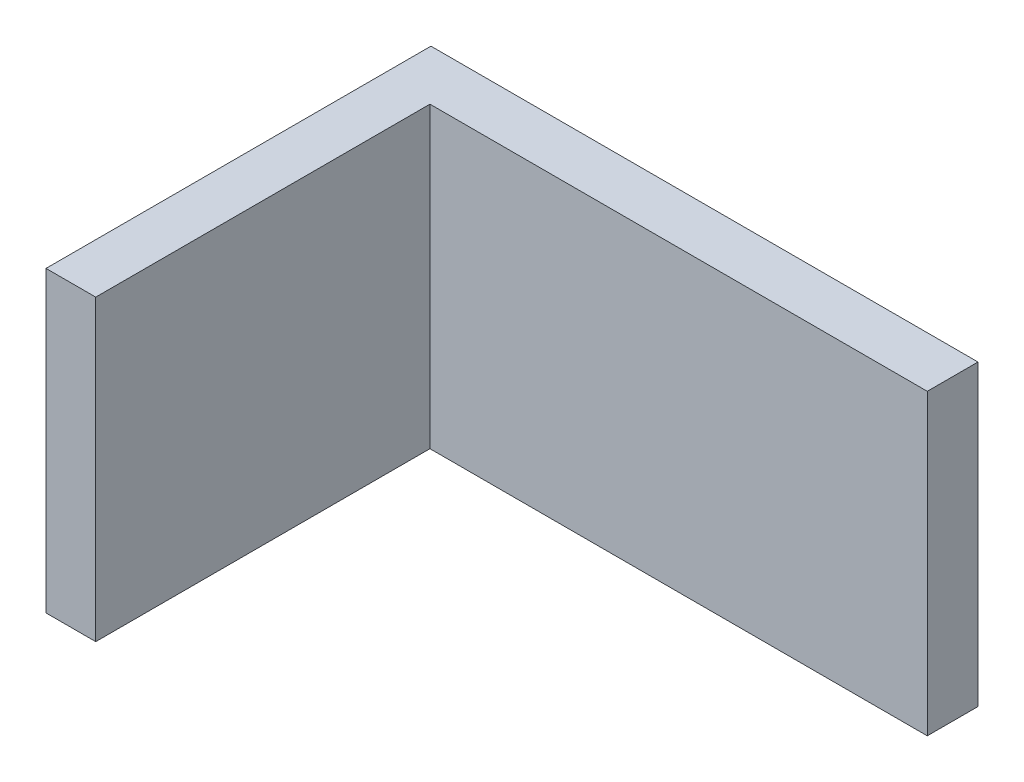
ISO-10303-21;
HEADER;
FILE_DESCRIPTION(('STEP AP214'),'2;1');
FILE_NAME('part.step','',(''),(''),'','','');
FILE_SCHEMA(('AUTOMOTIVE_DESIGN { 1 0 10303 214 1 1 1 1 }'));
ENDSEC;
DATA;
#1=APPLICATION_CONTEXT('core data for automotive mechanical design processes');
#2=APPLICATION_PROTOCOL_DEFINITION('international standard','automotive_design',2000,#1);
#3=PRODUCT_CONTEXT('',#1,'mechanical');
#4=PRODUCT('Part','Part','',(#3));
#5=PRODUCT_RELATED_PRODUCT_CATEGORY('part','',(#4));
#6=PRODUCT_DEFINITION_FORMATION('','',#4);
#7=PRODUCT_DEFINITION_CONTEXT('part definition',#1,'design');
#8=PRODUCT_DEFINITION('design','',#6,#7);
#9=PRODUCT_DEFINITION_SHAPE('','',#8);
#10=(LENGTH_UNIT() NAMED_UNIT(*) SI_UNIT(.MILLI.,.METRE.));
#11=(NAMED_UNIT(*) PLANE_ANGLE_UNIT() SI_UNIT($,.RADIAN.));
#12=(NAMED_UNIT(*) SI_UNIT($,.STERADIAN.) SOLID_ANGLE_UNIT());
#13=UNCERTAINTY_MEASURE_WITH_UNIT(LENGTH_MEASURE(1.E-05),#10,'distance_accuracy_value','');
#14=(GEOMETRIC_REPRESENTATION_CONTEXT(3) GLOBAL_UNCERTAINTY_ASSIGNED_CONTEXT((#13)) GLOBAL_UNIT_ASSIGNED_CONTEXT((#10,
#11,#12)) REPRESENTATION_CONTEXT('',''));
#15=CARTESIAN_POINT('',(0.,0.,0.));
#16=DIRECTION('',(0.,0.,1.));
#17=DIRECTION('',(1.,0.,0.));
#18=AXIS2_PLACEMENT_3D('',#15,#16,#17);
#19=CARTESIAN_POINT('',(-4.55,-0.9,0.));
#20=DIRECTION('',(0.,-1.,0.));
#21=DIRECTION('',(0.,0.,1.));
#22=AXIS2_PLACEMENT_3D('',#19,#20,#21);
#23=PLANE('',#22);
#24=DIRECTION('',(-1.,0.,0.));
#25=VECTOR('',#24,1.);
#26=CARTESIAN_POINT('',(-4.,-0.9,0.));
#27=LINE('',#26,#25);
#28=CARTESIAN_POINT('',(-4.,-0.9,0.));
#29=VERTEX_POINT('',#28);
#30=CARTESIAN_POINT('',(-4.55,-0.9,0.));
#31=VERTEX_POINT('',#30);
#32=EDGE_CURVE('E11',#29,#31,#27,.T.);
#33=ORIENTED_EDGE('',*,*,#32,.F.);
#34=DIRECTION('',(0.,0.,-1.));
#35=VECTOR('',#34,1.);
#36=CARTESIAN_POINT('',(-4.,-0.9,0.051));
#37=LINE('',#36,#35);
#38=CARTESIAN_POINT('',(-4.,-0.9,0.051));
#39=VERTEX_POINT('',#38);
#40=EDGE_CURVE('E24',#39,#29,#37,.T.);
#41=ORIENTED_EDGE('',*,*,#40,.F.);
#42=DIRECTION('',(1.,0.,0.));
#43=VECTOR('',#42,1.);
#44=CARTESIAN_POINT('',(-4.5,-0.9,0.051));
#45=LINE('',#44,#43);
#46=CARTESIAN_POINT('',(-4.5,-0.9,0.051));
#47=VERTEX_POINT('',#46);
#48=EDGE_CURVE('E87',#47,#39,#45,.T.);
#49=ORIENTED_EDGE('',*,*,#48,.F.);
#50=DIRECTION('',(0.,0.,-1.));
#51=VECTOR('',#50,1.);
#52=CARTESIAN_POINT('',(-4.5,-0.9,0.387));
#53=LINE('',#52,#51);
#54=CARTESIAN_POINT('',(-4.5,-0.9,0.387));
#55=VERTEX_POINT('',#54);
#56=EDGE_CURVE('E114',#55,#47,#53,.T.);
#57=ORIENTED_EDGE('',*,*,#56,.F.);
#58=DIRECTION('',(1.,0.,0.));
#59=VECTOR('',#58,1.);
#60=CARTESIAN_POINT('',(-4.55,-0.9,0.387));
#61=LINE('',#60,#59);
#62=CARTESIAN_POINT('',(-4.55,-0.9,0.387));
#63=VERTEX_POINT('',#62);
#64=EDGE_CURVE('E111',#63,#55,#61,.T.);
#65=ORIENTED_EDGE('',*,*,#64,.F.);
#66=DIRECTION('',(0.,0.,1.));
#67=VECTOR('',#66,1.);
#68=CARTESIAN_POINT('',(-4.55,-0.9,0.));
#69=LINE('',#68,#67);
#70=EDGE_CURVE('E108',#31,#63,#69,.T.);
#71=ORIENTED_EDGE('',*,*,#70,.F.);
#72=EDGE_LOOP('',(#33,#41,#49,#57,#65,#71));
#73=FACE_BOUND('',#72,.T.);
#74=ADVANCED_FACE('F17',(#73),#23,.T.);
#75=CARTESIAN_POINT('',(-4.,-0.6,0.));
#76=DIRECTION('',(0.,1.,0.));
#77=DIRECTION('',(0.,0.,1.));
#78=AXIS2_PLACEMENT_3D('',#75,#76,#77);
#79=PLANE('',#78);
#80=DIRECTION('',(1.,0.,0.));
#81=VECTOR('',#80,1.);
#82=CARTESIAN_POINT('',(-4.55,-0.6,0.));
#83=LINE('',#82,#81);
#84=CARTESIAN_POINT('',(-4.55,-0.6,0.));
#85=VERTEX_POINT('',#84);
#86=CARTESIAN_POINT('',(-4.,-0.6,0.));
#87=VERTEX_POINT('',#86);
#88=EDGE_CURVE('E106',#85,#87,#83,.T.);
#89=ORIENTED_EDGE('',*,*,#88,.F.);
#90=DIRECTION('',(0.,0.,-1.));
#91=VECTOR('',#90,1.);
#92=CARTESIAN_POINT('',(-4.55,-0.6,0.387));
#93=LINE('',#92,#91);
#94=CARTESIAN_POINT('',(-4.55,-0.6,0.387));
#95=VERTEX_POINT('',#94);
#96=EDGE_CURVE('E103',#95,#85,#93,.T.);
#97=ORIENTED_EDGE('',*,*,#96,.F.);
#98=DIRECTION('',(-1.,0.,0.));
#99=VECTOR('',#98,1.);
#100=CARTESIAN_POINT('',(-4.5,-0.6,0.387));
#101=LINE('',#100,#99);
#102=CARTESIAN_POINT('',(-4.5,-0.6,0.387));
#103=VERTEX_POINT('',#102);
#104=EDGE_CURVE('E100',#103,#95,#101,.T.);
#105=ORIENTED_EDGE('',*,*,#104,.F.);
#106=DIRECTION('',(0.,0.,1.));
#107=VECTOR('',#106,1.);
#108=CARTESIAN_POINT('',(-4.5,-0.6,0.051));
#109=LINE('',#108,#107);
#110=CARTESIAN_POINT('',(-4.5,-0.6,0.051));
#111=VERTEX_POINT('',#110);
#112=EDGE_CURVE('E72',#111,#103,#109,.T.);
#113=ORIENTED_EDGE('',*,*,#112,.F.);
#114=DIRECTION('',(-1.,0.,0.));
#115=VECTOR('',#114,1.);
#116=CARTESIAN_POINT('',(-4.,-0.6,0.051));
#117=LINE('',#116,#115);
#118=CARTESIAN_POINT('',(-4.,-0.6,0.051));
#119=VERTEX_POINT('',#118);
#120=EDGE_CURVE('E66',#119,#111,#117,.T.);
#121=ORIENTED_EDGE('',*,*,#120,.F.);
#122=DIRECTION('',(0.,0.,1.));
#123=VECTOR('',#122,1.);
#124=CARTESIAN_POINT('',(-4.,-0.6,0.));
#125=LINE('',#124,#123);
#126=EDGE_CURVE('E69',#87,#119,#125,.T.);
#127=ORIENTED_EDGE('',*,*,#126,.F.);
#128=EDGE_LOOP('',(#89,#97,#105,#113,#121,#127));
#129=FACE_BOUND('',#128,.T.);
#130=ADVANCED_FACE('F68',(#129),#79,.T.);
#131=CARTESIAN_POINT('',(-4.55,-0.9,0.387));
#132=DIRECTION('',(0.,0.,1.));
#133=DIRECTION('',(0.,1.,0.));
#134=AXIS2_PLACEMENT_3D('',#131,#132,#133);
#135=PLANE('',#134);
#136=ORIENTED_EDGE('',*,*,#64,.T.);
#137=DIRECTION('',(0.,-1.,0.));
#138=VECTOR('',#137,1.);
#139=CARTESIAN_POINT('',(-4.5,-0.6,0.387));
#140=LINE('',#139,#138);
#141=EDGE_CURVE('E83',#103,#55,#140,.T.);
#142=ORIENTED_EDGE('',*,*,#141,.F.);
#143=ORIENTED_EDGE('',*,*,#104,.T.);
#144=DIRECTION('',(0.,1.,0.));
#145=VECTOR('',#144,1.);
#146=CARTESIAN_POINT('',(-4.55,-0.9,0.387));
#147=LINE('',#146,#145);
#148=EDGE_CURVE('E88',#63,#95,#147,.T.);
#149=ORIENTED_EDGE('',*,*,#148,.F.);
#150=EDGE_LOOP('',(#136,#142,#143,#149));
#151=FACE_BOUND('',#150,.T.);
#152=ADVANCED_FACE('F125',(#151),#135,.T.);
#153=CARTESIAN_POINT('',(-4.5,-0.9,0.051));
#154=DIRECTION('',(0.,0.,1.));
#155=DIRECTION('',(0.,1.,0.));
#156=AXIS2_PLACEMENT_3D('',#153,#154,#155);
#157=PLANE('',#156);
#158=ORIENTED_EDGE('',*,*,#48,.T.);
#159=DIRECTION('',(0.,-1.,0.));
#160=VECTOR('',#159,1.);
#161=CARTESIAN_POINT('',(-4.,-0.6,0.051));
#162=LINE('',#161,#160);
#163=EDGE_CURVE('E81',#119,#39,#162,.T.);
#164=ORIENTED_EDGE('',*,*,#163,.F.);
#165=ORIENTED_EDGE('',*,*,#120,.T.);
#166=DIRECTION('',(0.,1.,0.));
#167=VECTOR('',#166,1.);
#168=CARTESIAN_POINT('',(-4.5,-0.9,0.051));
#169=LINE('',#168,#167);
#170=EDGE_CURVE('E89',#47,#111,#169,.T.);
#171=ORIENTED_EDGE('',*,*,#170,.F.);
#172=EDGE_LOOP('',(#158,#164,#165,#171));
#173=FACE_BOUND('',#172,.T.);
#174=ADVANCED_FACE('F86',(#173),#157,.T.);
#175=CARTESIAN_POINT('',(-4.55,-0.6,0.));
#176=DIRECTION('',(-1.,0.,0.));
#177=DIRECTION('',(0.,0.,1.));
#178=AXIS2_PLACEMENT_3D('',#175,#176,#177);
#179=PLANE('',#178);
#180=DIRECTION('',(0.,1.,0.));
#181=VECTOR('',#180,1.);
#182=CARTESIAN_POINT('',(-4.55,-0.9,0.));
#183=LINE('',#182,#181);
#184=EDGE_CURVE('E93',#31,#85,#183,.T.);
#185=ORIENTED_EDGE('',*,*,#184,.F.);
#186=ORIENTED_EDGE('',*,*,#70,.T.);
#187=ORIENTED_EDGE('',*,*,#148,.T.);
#188=ORIENTED_EDGE('',*,*,#96,.T.);
#189=EDGE_LOOP('',(#185,#186,#187,#188));
#190=FACE_BOUND('',#189,.T.);
#191=ADVANCED_FACE('F121',(#190),#179,.T.);
#192=CARTESIAN_POINT('',(-4.,-0.9,0.));
#193=DIRECTION('',(1.,0.,0.));
#194=DIRECTION('',(0.,0.,1.));
#195=AXIS2_PLACEMENT_3D('',#192,#193,#194);
#196=PLANE('',#195);
#197=DIRECTION('',(0.,-1.,0.));
#198=VECTOR('',#197,1.);
#199=CARTESIAN_POINT('',(-4.,-0.6,0.));
#200=LINE('',#199,#198);
#201=EDGE_CURVE('E82',#87,#29,#200,.T.);
#202=ORIENTED_EDGE('',*,*,#201,.F.);
#203=ORIENTED_EDGE('',*,*,#126,.T.);
#204=ORIENTED_EDGE('',*,*,#163,.T.);
#205=ORIENTED_EDGE('',*,*,#40,.T.);
#206=EDGE_LOOP('',(#202,#203,#204,#205));
#207=FACE_BOUND('',#206,.T.);
#208=ADVANCED_FACE('F80',(#207),#196,.T.);
#209=CARTESIAN_POINT('',(-4.5,-0.9,0.051));
#210=DIRECTION('',(1.,0.,0.));
#211=DIRECTION('',(0.,0.,1.));
#212=AXIS2_PLACEMENT_3D('',#209,#210,#211);
#213=PLANE('',#212);
#214=ORIENTED_EDGE('',*,*,#170,.T.);
#215=ORIENTED_EDGE('',*,*,#112,.T.);
#216=ORIENTED_EDGE('',*,*,#141,.T.);
#217=ORIENTED_EDGE('',*,*,#56,.T.);
#218=EDGE_LOOP('',(#214,#215,#216,#217));
#219=FACE_BOUND('',#218,.T.);
#220=ADVANCED_FACE('F127',(#219),#213,.T.);
#221=CARTESIAN_POINT('',(-4.55,-0.6,0.));
#222=DIRECTION('',(0.,0.,-1.));
#223=DIRECTION('',(0.,1.,0.));
#224=AXIS2_PLACEMENT_3D('',#221,#222,#223);
#225=PLANE('',#224);
#226=ORIENTED_EDGE('',*,*,#88,.T.);
#227=ORIENTED_EDGE('',*,*,#201,.T.);
#228=ORIENTED_EDGE('',*,*,#32,.T.);
#229=ORIENTED_EDGE('',*,*,#184,.T.);
#230=EDGE_LOOP('',(#226,#227,#228,#229));
#231=FACE_BOUND('',#230,.T.);
#232=ADVANCED_FACE('F117',(#231),#225,.T.);
#233=CLOSED_SHELL('',(#74,#130,#152,#174,#191,#208,#220,#232));
#234=MANIFOLD_SOLID_BREP('B1',#233);
#235=ADVANCED_BREP_SHAPE_REPRESENTATION('',(#18,#234),#14);
#236=SHAPE_DEFINITION_REPRESENTATION(#9,#235);
ENDSEC;
END-ISO-10303-21;
